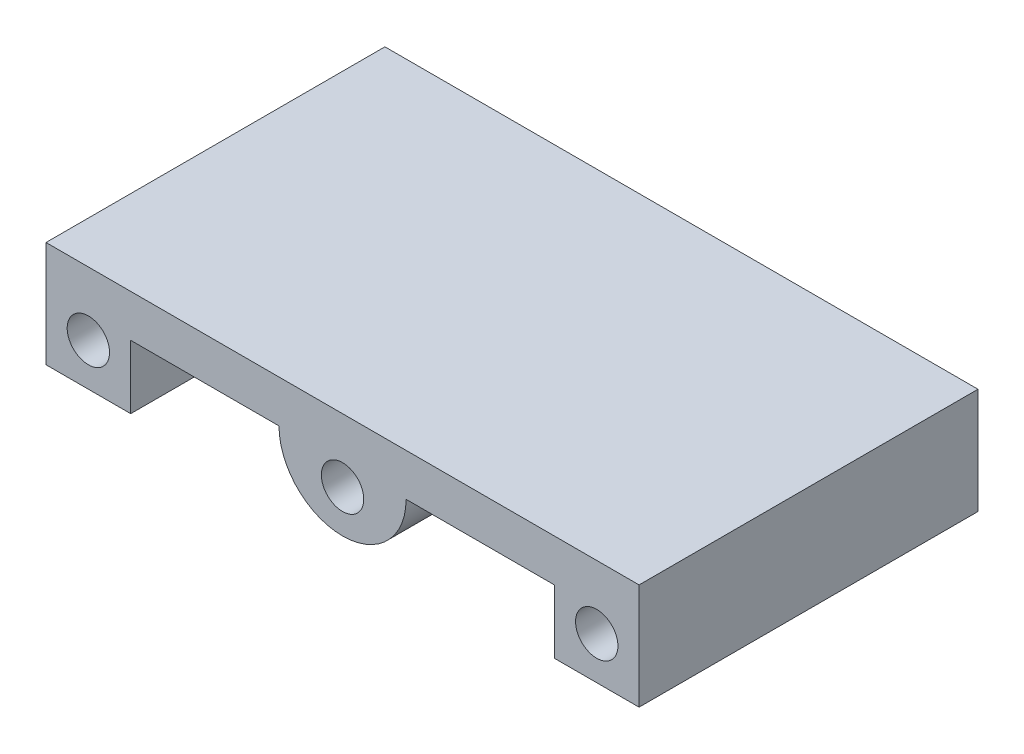
ISO-10303-21;
HEADER;
FILE_DESCRIPTION(('STEP AP214'),'2;1');
FILE_NAME('part.step','',(''),(''),'','','');
FILE_SCHEMA(('AUTOMOTIVE_DESIGN { 1 0 10303 214 1 1 1 1 }'));
ENDSEC;
DATA;
#1=APPLICATION_CONTEXT('core data for automotive mechanical design processes');
#2=APPLICATION_PROTOCOL_DEFINITION('international standard','automotive_design',2000,#1);
#3=PRODUCT_CONTEXT('',#1,'mechanical');
#4=PRODUCT('Part','Part','',(#3));
#5=PRODUCT_RELATED_PRODUCT_CATEGORY('part','',(#4));
#6=PRODUCT_DEFINITION_FORMATION('','',#4);
#7=PRODUCT_DEFINITION_CONTEXT('part definition',#1,'design');
#8=PRODUCT_DEFINITION('design','',#6,#7);
#9=PRODUCT_DEFINITION_SHAPE('','',#8);
#10=(LENGTH_UNIT() NAMED_UNIT(*) SI_UNIT(.MILLI.,.METRE.));
#11=(NAMED_UNIT(*) PLANE_ANGLE_UNIT() SI_UNIT($,.RADIAN.));
#12=(NAMED_UNIT(*) SI_UNIT($,.STERADIAN.) SOLID_ANGLE_UNIT());
#13=UNCERTAINTY_MEASURE_WITH_UNIT(LENGTH_MEASURE(1.E-05),#10,'distance_accuracy_value','');
#14=(GEOMETRIC_REPRESENTATION_CONTEXT(3) GLOBAL_UNCERTAINTY_ASSIGNED_CONTEXT((#13)) GLOBAL_UNIT_ASSIGNED_CONTEXT((#10,
#11,#12)) REPRESENTATION_CONTEXT('',''));
#15=CARTESIAN_POINT('',(0.,0.,0.));
#16=DIRECTION('',(0.,0.,1.));
#17=DIRECTION('',(1.,0.,0.));
#18=AXIS2_PLACEMENT_3D('',#15,#16,#17);
#19=CARTESIAN_POINT('',(0.,0.,0.));
#20=DIRECTION('',(0.,-1.,0.));
#21=DIRECTION('',(0.,0.,-1.));
#22=AXIS2_PLACEMENT_3D('',#19,#20,#21);
#23=PLANE('',#22);
#24=DIRECTION('',(-1.,0.,0.));
#25=VECTOR('',#24,1.);
#26=CARTESIAN_POINT('',(-88.9,0.,-50.8));
#27=LINE('',#26,#25);
#28=CARTESIAN_POINT('',(63.5,0.,-50.8));
#29=VERTEX_POINT('',#28);
#30=CARTESIAN_POINT('',(19.05,0.,-50.8));
#31=VERTEX_POINT('',#30);
#32=EDGE_CURVE('E134',#29,#31,#27,.T.);
#33=ORIENTED_EDGE('',*,*,#32,.F.);
#34=DIRECTION('',(0.,0.,1.));
#35=VECTOR('',#34,1.);
#36=CARTESIAN_POINT('',(63.5,0.,-82.55));
#37=LINE('',#36,#35);
#38=CARTESIAN_POINT('',(63.5,0.,50.8));
#39=VERTEX_POINT('',#38);
#40=EDGE_CURVE('E119',#29,#39,#37,.T.);
#41=ORIENTED_EDGE('',*,*,#40,.T.);
#42=DIRECTION('',(1.,0.,0.));
#43=VECTOR('',#42,1.);
#44=CARTESIAN_POINT('',(-88.9,0.,50.8));
#45=LINE('',#44,#43);
#46=CARTESIAN_POINT('',(19.05,0.,50.8));
#47=VERTEX_POINT('',#46);
#48=EDGE_CURVE('E133',#47,#39,#45,.T.);
#49=ORIENTED_EDGE('',*,*,#48,.F.);
#50=DIRECTION('',(0.,0.,1.));
#51=VECTOR('',#50,1.);
#52=CARTESIAN_POINT('',(19.05,0.,-93.397094971371));
#53=LINE('',#52,#51);
#54=EDGE_CURVE('E190',#31,#47,#53,.T.);
#55=ORIENTED_EDGE('',*,*,#54,.F.);
#56=EDGE_LOOP('',(#33,#41,#49,#55));
#57=FACE_BOUND('',#56,.T.);
#58=ADVANCED_FACE('F36',(#57),#23,.T.);
#59=CARTESIAN_POINT('',(88.9,12.7,50.8));
#60=DIRECTION('',(-1.,0.,0.));
#61=DIRECTION('',(0.,0.,1.));
#62=AXIS2_PLACEMENT_3D('',#59,#60,#61);
#63=PLANE('',#62);
#64=DIRECTION('',(0.,-1.,0.));
#65=VECTOR('',#64,1.);
#66=CARTESIAN_POINT('',(88.9,12.7,50.8));
#67=LINE('',#66,#65);
#68=CARTESIAN_POINT('',(88.9,12.7,50.8));
#69=VERTEX_POINT('',#68);
#70=CARTESIAN_POINT('',(88.9,-19.05,50.8));
#71=VERTEX_POINT('',#70);
#72=EDGE_CURVE('E146',#69,#71,#67,.T.);
#73=ORIENTED_EDGE('',*,*,#72,.T.);
#74=DIRECTION('',(0.,0.,1.));
#75=VECTOR('',#74,1.);
#76=CARTESIAN_POINT('',(88.9,-19.05,-82.55));
#77=LINE('',#76,#75);
#78=CARTESIAN_POINT('',(88.9,-19.05,-50.8));
#79=VERTEX_POINT('',#78);
#80=EDGE_CURVE('E202',#79,#71,#77,.T.);
#81=ORIENTED_EDGE('',*,*,#80,.F.);
#82=DIRECTION('',(0.,-1.,0.));
#83=VECTOR('',#82,1.);
#84=CARTESIAN_POINT('',(88.9,12.7,-50.8));
#85=LINE('',#84,#83);
#86=CARTESIAN_POINT('',(88.9,12.7,-50.8));
#87=VERTEX_POINT('',#86);
#88=EDGE_CURVE('E11',#87,#79,#85,.T.);
#89=ORIENTED_EDGE('',*,*,#88,.F.);
#90=DIRECTION('',(0.,0.,-1.));
#91=VECTOR('',#90,1.);
#92=CARTESIAN_POINT('',(88.9,12.7,50.8));
#93=LINE('',#92,#91);
#94=EDGE_CURVE('E141',#69,#87,#93,.T.);
#95=ORIENTED_EDGE('',*,*,#94,.F.);
#96=EDGE_LOOP('',(#73,#81,#89,#95));
#97=FACE_BOUND('',#96,.T.);
#98=ADVANCED_FACE('F38',(#97),#63,.F.);
#99=CARTESIAN_POINT('',(-88.9,12.7,-50.8));
#100=DIRECTION('',(0.,0.,1.));
#101=DIRECTION('',(1.,0.,0.));
#102=AXIS2_PLACEMENT_3D('',#99,#100,#101);
#103=PLANE('',#102);
#104=CARTESIAN_POINT('',(-76.2,-6.35,-50.8));
#105=DIRECTION('',(0.,0.,1.));
#106=DIRECTION('',(1.,0.,0.));
#107=AXIS2_PLACEMENT_3D('',#104,#105,#106);
#108=CIRCLE('',#107,6.35);
#109=CARTESIAN_POINT('',(-69.85,-6.35,-50.8));
#110=VERTEX_POINT('',#109);
#111=EDGE_CURVE('E128',#110,#110,#108,.F.);
#112=ORIENTED_EDGE('',*,*,#111,.F.);
#113=EDGE_LOOP('',(#112));
#114=FACE_BOUND('',#113,.T.);
#115=CARTESIAN_POINT('',(76.2,-6.35,-50.8));
#116=DIRECTION('',(0.,0.,1.));
#117=DIRECTION('',(1.,0.,0.));
#118=AXIS2_PLACEMENT_3D('',#115,#116,#117);
#119=CIRCLE('',#118,6.35);
#120=CARTESIAN_POINT('',(82.55,-6.35,-50.8));
#121=VERTEX_POINT('',#120);
#122=EDGE_CURVE('E253',#121,#121,#119,.F.);
#123=ORIENTED_EDGE('',*,*,#122,.F.);
#124=EDGE_LOOP('',(#123));
#125=FACE_BOUND('',#124,.T.);
#126=CARTESIAN_POINT('',(0.,-6.35,-50.8));
#127=DIRECTION('',(0.,0.,1.));
#128=DIRECTION('',(1.,0.,0.));
#129=AXIS2_PLACEMENT_3D('',#126,#127,#128);
#130=CIRCLE('',#129,6.35);
#131=CARTESIAN_POINT('',(6.35,-6.35,-50.8));
#132=VERTEX_POINT('',#131);
#133=EDGE_CURVE('E184',#132,#132,#130,.F.);
#134=ORIENTED_EDGE('',*,*,#133,.F.);
#135=EDGE_LOOP('',(#134));
#136=FACE_BOUND('',#135,.T.);
#137=ORIENTED_EDGE('',*,*,#88,.T.);
#138=DIRECTION('',(1.,0.,0.));
#139=VECTOR('',#138,1.);
#140=CARTESIAN_POINT('',(88.9,-19.05,-50.8));
#141=LINE('',#140,#139);
#142=CARTESIAN_POINT('',(63.5,-19.05,-50.8));
#143=VERTEX_POINT('',#142);
#144=EDGE_CURVE('E204',#143,#79,#141,.T.);
#145=ORIENTED_EDGE('',*,*,#144,.F.);
#146=DIRECTION('',(0.,-1.,0.));
#147=VECTOR('',#146,1.);
#148=CARTESIAN_POINT('',(63.5,-19.05,-50.8));
#149=LINE('',#148,#147);
#150=EDGE_CURVE('E205',#29,#143,#149,.T.);
#151=ORIENTED_EDGE('',*,*,#150,.F.);
#152=ORIENTED_EDGE('',*,*,#32,.T.);
#153=CARTESIAN_POINT('',(0.,0.,-50.8));
#154=DIRECTION('',(0.,0.,1.));
#155=DIRECTION('',(1.,0.,0.));
#156=AXIS2_PLACEMENT_3D('',#153,#154,#155);
#157=CIRCLE('',#156,19.05);
#158=CARTESIAN_POINT('',(-19.05,0.,-50.8));
#159=VERTEX_POINT('',#158);
#160=EDGE_CURVE('E187',#31,#159,#157,.F.);
#161=ORIENTED_EDGE('',*,*,#160,.T.);
#162=CARTESIAN_POINT('',(-63.5,0.,-50.8));
#163=VERTEX_POINT('',#162);
#164=EDGE_CURVE('E142',#159,#163,#27,.T.);
#165=ORIENTED_EDGE('',*,*,#164,.T.);
#166=DIRECTION('',(0.,-1.,0.));
#167=VECTOR('',#166,1.);
#168=CARTESIAN_POINT('',(-63.5,-19.05,-50.8));
#169=LINE('',#168,#167);
#170=CARTESIAN_POINT('',(-63.5,-19.05,-50.8));
#171=VERTEX_POINT('',#170);
#172=EDGE_CURVE('E165',#163,#171,#169,.T.);
#173=ORIENTED_EDGE('',*,*,#172,.T.);
#174=DIRECTION('',(-1.,0.,0.));
#175=VECTOR('',#174,1.);
#176=CARTESIAN_POINT('',(-88.9,-19.05,-50.8));
#177=LINE('',#176,#175);
#178=CARTESIAN_POINT('',(-88.9,-19.05,-50.8));
#179=VERTEX_POINT('',#178);
#180=EDGE_CURVE('E162',#171,#179,#177,.T.);
#181=ORIENTED_EDGE('',*,*,#180,.T.);
#182=DIRECTION('',(0.,-1.,0.));
#183=VECTOR('',#182,1.);
#184=CARTESIAN_POINT('',(-88.9,12.7,-50.8));
#185=LINE('',#184,#183);
#186=CARTESIAN_POINT('',(-88.9,12.7,-50.8));
#187=VERTEX_POINT('',#186);
#188=EDGE_CURVE('E44',#187,#179,#185,.T.);
#189=ORIENTED_EDGE('',*,*,#188,.F.);
#190=DIRECTION('',(-1.,0.,0.));
#191=VECTOR('',#190,1.);
#192=CARTESIAN_POINT('',(-88.9,12.7,-50.8));
#193=LINE('',#192,#191);
#194=EDGE_CURVE('E194',#87,#187,#193,.T.);
#195=ORIENTED_EDGE('',*,*,#194,.F.);
#196=EDGE_LOOP('',(#137,#145,#151,#152,#161,#165,#173,#181,#189,#195));
#197=FACE_BOUND('',#196,.T.);
#198=ADVANCED_FACE('F163',(#114,#125,#136,#197),#103,.F.);
#199=CARTESIAN_POINT('',(-88.9,12.7,50.8));
#200=DIRECTION('',(1.,0.,0.));
#201=DIRECTION('',(0.,0.,-1.));
#202=AXIS2_PLACEMENT_3D('',#199,#200,#201);
#203=PLANE('',#202);
#204=ORIENTED_EDGE('',*,*,#188,.T.);
#205=DIRECTION('',(0.,0.,1.));
#206=VECTOR('',#205,1.);
#207=CARTESIAN_POINT('',(-88.9,-19.05,-82.55));
#208=LINE('',#207,#206);
#209=CARTESIAN_POINT('',(-88.9,-19.05,50.8));
#210=VERTEX_POINT('',#209);
#211=EDGE_CURVE('E157',#179,#210,#208,.T.);
#212=ORIENTED_EDGE('',*,*,#211,.T.);
#213=DIRECTION('',(0.,-1.,0.));
#214=VECTOR('',#213,1.);
#215=CARTESIAN_POINT('',(-88.9,12.7,50.8));
#216=LINE('',#215,#214);
#217=CARTESIAN_POINT('',(-88.9,12.7,50.8));
#218=VERTEX_POINT('',#217);
#219=EDGE_CURVE('E148',#218,#210,#216,.T.);
#220=ORIENTED_EDGE('',*,*,#219,.F.);
#221=DIRECTION('',(0.,0.,1.));
#222=VECTOR('',#221,1.);
#223=CARTESIAN_POINT('',(-88.9,12.7,50.8));
#224=LINE('',#223,#222);
#225=EDGE_CURVE('E159',#187,#218,#224,.T.);
#226=ORIENTED_EDGE('',*,*,#225,.F.);
#227=EDGE_LOOP('',(#204,#212,#220,#226));
#228=FACE_BOUND('',#227,.T.);
#229=ADVANCED_FACE('F154',(#228),#203,.F.);
#230=CARTESIAN_POINT('',(-88.9,12.7,50.8));
#231=DIRECTION('',(0.,0.,-1.));
#232=DIRECTION('',(-1.,0.,0.));
#233=AXIS2_PLACEMENT_3D('',#230,#231,#232);
#234=PLANE('',#233);
#235=CARTESIAN_POINT('',(-76.2,-6.35,50.8));
#236=DIRECTION('',(0.,0.,1.));
#237=DIRECTION('',(1.,0.,0.));
#238=AXIS2_PLACEMENT_3D('',#235,#236,#237);
#239=CIRCLE('',#238,6.35);
#240=CARTESIAN_POINT('',(-69.85,-6.35,50.8));
#241=VERTEX_POINT('',#240);
#242=EDGE_CURVE('E259',#241,#241,#239,.T.);
#243=ORIENTED_EDGE('',*,*,#242,.F.);
#244=EDGE_LOOP('',(#243));
#245=FACE_BOUND('',#244,.T.);
#246=CARTESIAN_POINT('',(76.2,-6.35,50.8));
#247=DIRECTION('',(0.,0.,1.));
#248=DIRECTION('',(1.,0.,0.));
#249=AXIS2_PLACEMENT_3D('',#246,#247,#248);
#250=CIRCLE('',#249,6.35);
#251=CARTESIAN_POINT('',(82.55,-6.35,50.8));
#252=VERTEX_POINT('',#251);
#253=EDGE_CURVE('E260',#252,#252,#250,.T.);
#254=ORIENTED_EDGE('',*,*,#253,.F.);
#255=EDGE_LOOP('',(#254));
#256=FACE_BOUND('',#255,.T.);
#257=CARTESIAN_POINT('',(0.,-6.35,50.8));
#258=DIRECTION('',(0.,0.,1.));
#259=DIRECTION('',(1.,0.,0.));
#260=AXIS2_PLACEMENT_3D('',#257,#258,#259);
#261=CIRCLE('',#260,6.35);
#262=CARTESIAN_POINT('',(6.35,-6.35,50.8));
#263=VERTEX_POINT('',#262);
#264=EDGE_CURVE('E181',#263,#263,#261,.T.);
#265=ORIENTED_EDGE('',*,*,#264,.F.);
#266=EDGE_LOOP('',(#265));
#267=FACE_BOUND('',#266,.T.);
#268=ORIENTED_EDGE('',*,*,#219,.T.);
#269=DIRECTION('',(1.,0.,0.));
#270=VECTOR('',#269,1.);
#271=CARTESIAN_POINT('',(-88.9,-19.05,50.8));
#272=LINE('',#271,#270);
#273=CARTESIAN_POINT('',(-63.5,-19.05,50.8));
#274=VERTEX_POINT('',#273);
#275=EDGE_CURVE('E172',#210,#274,#272,.T.);
#276=ORIENTED_EDGE('',*,*,#275,.T.);
#277=DIRECTION('',(0.,1.,0.));
#278=VECTOR('',#277,1.);
#279=CARTESIAN_POINT('',(-63.5,-19.05,50.8));
#280=LINE('',#279,#278);
#281=CARTESIAN_POINT('',(-63.5,0.,50.8));
#282=VERTEX_POINT('',#281);
#283=EDGE_CURVE('E174',#274,#282,#280,.T.);
#284=ORIENTED_EDGE('',*,*,#283,.T.);
#285=CARTESIAN_POINT('',(-19.05,0.,50.8));
#286=VERTEX_POINT('',#285);
#287=EDGE_CURVE('E139',#282,#286,#45,.T.);
#288=ORIENTED_EDGE('',*,*,#287,.T.);
#289=CARTESIAN_POINT('',(0.,0.,50.8));
#290=DIRECTION('',(0.,0.,1.));
#291=DIRECTION('',(1.,0.,0.));
#292=AXIS2_PLACEMENT_3D('',#289,#290,#291);
#293=CIRCLE('',#292,19.05);
#294=EDGE_CURVE('E138',#286,#47,#293,.T.);
#295=ORIENTED_EDGE('',*,*,#294,.T.);
#296=ORIENTED_EDGE('',*,*,#48,.T.);
#297=DIRECTION('',(0.,1.,0.));
#298=VECTOR('',#297,1.);
#299=CARTESIAN_POINT('',(63.5,-19.05,50.8));
#300=LINE('',#299,#298);
#301=CARTESIAN_POINT('',(63.5,-19.05,50.8));
#302=VERTEX_POINT('',#301);
#303=EDGE_CURVE('E115',#302,#39,#300,.T.);
#304=ORIENTED_EDGE('',*,*,#303,.F.);
#305=DIRECTION('',(-1.,0.,0.));
#306=VECTOR('',#305,1.);
#307=CARTESIAN_POINT('',(88.9,-19.05,50.8));
#308=LINE('',#307,#306);
#309=EDGE_CURVE('E127',#71,#302,#308,.T.);
#310=ORIENTED_EDGE('',*,*,#309,.F.);
#311=ORIENTED_EDGE('',*,*,#72,.F.);
#312=DIRECTION('',(1.,0.,0.));
#313=VECTOR('',#312,1.);
#314=CARTESIAN_POINT('',(-88.9,12.7,50.8));
#315=LINE('',#314,#313);
#316=EDGE_CURVE('E59',#218,#69,#315,.T.);
#317=ORIENTED_EDGE('',*,*,#316,.F.);
#318=EDGE_LOOP('',(#268,#276,#284,#288,#295,#296,#304,#310,#311,#317));
#319=FACE_BOUND('',#318,.T.);
#320=ADVANCED_FACE('F137',(#245,#256,#267,#319),#234,.F.);
#321=CARTESIAN_POINT('',(0.,12.7,0.));
#322=DIRECTION('',(0.,-1.,0.));
#323=DIRECTION('',(0.,0.,-1.));
#324=AXIS2_PLACEMENT_3D('',#321,#322,#323);
#325=PLANE('',#324);
#326=ORIENTED_EDGE('',*,*,#94,.T.);
#327=ORIENTED_EDGE('',*,*,#194,.T.);
#328=ORIENTED_EDGE('',*,*,#225,.T.);
#329=ORIENTED_EDGE('',*,*,#316,.T.);
#330=EDGE_LOOP('',(#326,#327,#328,#329));
#331=FACE_BOUND('',#330,.T.);
#332=ADVANCED_FACE('F196',(#331),#325,.F.);
#333=DIRECTION('',(0.,0.,1.));
#334=VECTOR('',#333,1.);
#335=CARTESIAN_POINT('',(-63.5,0.,-82.55));
#336=LINE('',#335,#334);
#337=EDGE_CURVE('E168',#163,#282,#336,.T.);
#338=ORIENTED_EDGE('',*,*,#337,.F.);
#339=ORIENTED_EDGE('',*,*,#164,.F.);
#340=DIRECTION('',(0.,0.,1.));
#341=VECTOR('',#340,1.);
#342=CARTESIAN_POINT('',(-19.05,0.,-93.397094971371));
#343=LINE('',#342,#341);
#344=EDGE_CURVE('E51',#159,#286,#343,.T.);
#345=ORIENTED_EDGE('',*,*,#344,.T.);
#346=ORIENTED_EDGE('',*,*,#287,.F.);
#347=EDGE_LOOP('',(#338,#339,#345,#346));
#348=FACE_BOUND('',#347,.T.);
#349=ADVANCED_FACE('F221',(#348),#23,.T.);
#350=CARTESIAN_POINT('',(0.,0.,-93.397094971371));
#351=DIRECTION('',(0.,0.,1.));
#352=DIRECTION('',(1.,0.,0.));
#353=AXIS2_PLACEMENT_3D('',#350,#351,#352);
#354=CYLINDRICAL_SURFACE('',#353,19.05);
#355=ORIENTED_EDGE('',*,*,#160,.F.);
#356=ORIENTED_EDGE('',*,*,#54,.T.);
#357=ORIENTED_EDGE('',*,*,#294,.F.);
#358=ORIENTED_EDGE('',*,*,#344,.F.);
#359=EDGE_LOOP('',(#355,#356,#357,#358));
#360=FACE_BOUND('',#359,.T.);
#361=ADVANCED_FACE('F222',(#360),#354,.T.);
#362=CARTESIAN_POINT('',(0.,-6.35,-68.7605122421383));
#363=DIRECTION('',(0.,0.,1.));
#364=DIRECTION('',(1.,0.,0.));
#365=AXIS2_PLACEMENT_3D('',#362,#363,#364);
#366=CYLINDRICAL_SURFACE('',#365,6.35);
#367=ORIENTED_EDGE('',*,*,#133,.T.);
#368=EDGE_LOOP('',(#367));
#369=FACE_BOUND('',#368,.T.);
#370=ORIENTED_EDGE('',*,*,#264,.T.);
#371=EDGE_LOOP('',(#370));
#372=FACE_BOUND('',#371,.T.);
#373=ADVANCED_FACE('F224',(#369,#372),#366,.F.);
#374=CARTESIAN_POINT('',(-63.5,-19.05,-82.55));
#375=DIRECTION('',(1.,0.,0.));
#376=DIRECTION('',(0.,0.,-1.));
#377=AXIS2_PLACEMENT_3D('',#374,#375,#376);
#378=PLANE('',#377);
#379=ORIENTED_EDGE('',*,*,#172,.F.);
#380=ORIENTED_EDGE('',*,*,#337,.T.);
#381=ORIENTED_EDGE('',*,*,#283,.F.);
#382=DIRECTION('',(0.,0.,1.));
#383=VECTOR('',#382,1.);
#384=CARTESIAN_POINT('',(-63.5,-19.05,-82.55));
#385=LINE('',#384,#383);
#386=EDGE_CURVE('E173',#171,#274,#385,.T.);
#387=ORIENTED_EDGE('',*,*,#386,.F.);
#388=EDGE_LOOP('',(#379,#380,#381,#387));
#389=FACE_BOUND('',#388,.T.);
#390=ADVANCED_FACE('F217',(#389),#378,.T.);
#391=CARTESIAN_POINT('',(-88.9,-19.05,-82.55));
#392=DIRECTION('',(0.,-1.,0.));
#393=DIRECTION('',(0.,0.,-1.));
#394=AXIS2_PLACEMENT_3D('',#391,#392,#393);
#395=PLANE('',#394);
#396=ORIENTED_EDGE('',*,*,#180,.F.);
#397=ORIENTED_EDGE('',*,*,#386,.T.);
#398=ORIENTED_EDGE('',*,*,#275,.F.);
#399=ORIENTED_EDGE('',*,*,#211,.F.);
#400=EDGE_LOOP('',(#396,#397,#398,#399));
#401=FACE_BOUND('',#400,.T.);
#402=ADVANCED_FACE('F170',(#401),#395,.T.);
#403=CARTESIAN_POINT('',(63.5,-19.05,-82.55));
#404=DIRECTION('',(1.,0.,0.));
#405=DIRECTION('',(0.,0.,-1.));
#406=AXIS2_PLACEMENT_3D('',#403,#404,#405);
#407=PLANE('',#406);
#408=ORIENTED_EDGE('',*,*,#40,.F.);
#409=ORIENTED_EDGE('',*,*,#150,.T.);
#410=DIRECTION('',(0.,0.,1.));
#411=VECTOR('',#410,1.);
#412=CARTESIAN_POINT('',(63.5,-19.05,-82.55));
#413=LINE('',#412,#411);
#414=EDGE_CURVE('E122',#143,#302,#413,.T.);
#415=ORIENTED_EDGE('',*,*,#414,.T.);
#416=ORIENTED_EDGE('',*,*,#303,.T.);
#417=EDGE_LOOP('',(#408,#409,#415,#416));
#418=FACE_BOUND('',#417,.T.);
#419=ADVANCED_FACE('F117',(#418),#407,.F.);
#420=CARTESIAN_POINT('',(88.9,-19.05,-82.55));
#421=DIRECTION('',(0.,1.,0.));
#422=DIRECTION('',(0.,0.,1.));
#423=AXIS2_PLACEMENT_3D('',#420,#421,#422);
#424=PLANE('',#423);
#425=ORIENTED_EDGE('',*,*,#414,.F.);
#426=ORIENTED_EDGE('',*,*,#144,.T.);
#427=ORIENTED_EDGE('',*,*,#80,.T.);
#428=ORIENTED_EDGE('',*,*,#309,.T.);
#429=EDGE_LOOP('',(#425,#426,#427,#428));
#430=FACE_BOUND('',#429,.T.);
#431=ADVANCED_FACE('F208',(#430),#424,.F.);
#432=CARTESIAN_POINT('',(76.2,-6.35,-68.7605122421383));
#433=DIRECTION('',(0.,0.,1.));
#434=DIRECTION('',(1.,0.,0.));
#435=AXIS2_PLACEMENT_3D('',#432,#433,#434);
#436=CYLINDRICAL_SURFACE('',#435,6.35);
#437=ORIENTED_EDGE('',*,*,#122,.T.);
#438=EDGE_LOOP('',(#437));
#439=FACE_BOUND('',#438,.T.);
#440=ORIENTED_EDGE('',*,*,#253,.T.);
#441=EDGE_LOOP('',(#440));
#442=FACE_BOUND('',#441,.T.);
#443=ADVANCED_FACE('F272',(#439,#442),#436,.F.);
#444=CARTESIAN_POINT('',(-76.2,-6.35,-68.7605122421383));
#445=DIRECTION('',(0.,0.,1.));
#446=DIRECTION('',(1.,0.,0.));
#447=AXIS2_PLACEMENT_3D('',#444,#445,#446);
#448=CYLINDRICAL_SURFACE('',#447,6.35);
#449=ORIENTED_EDGE('',*,*,#111,.T.);
#450=EDGE_LOOP('',(#449));
#451=FACE_BOUND('',#450,.T.);
#452=ORIENTED_EDGE('',*,*,#242,.T.);
#453=EDGE_LOOP('',(#452));
#454=FACE_BOUND('',#453,.T.);
#455=ADVANCED_FACE('F269',(#451,#454),#448,.F.);
#456=CLOSED_SHELL('',(#58,#98,#198,#229,#320,#332,#349,#361,#373,#390,#402,#419,#431,#443,#455));
#457=MANIFOLD_SOLID_BREP('B2',#456);
#458=ADVANCED_BREP_SHAPE_REPRESENTATION('',(#18,#457),#14);
#459=SHAPE_DEFINITION_REPRESENTATION(#9,#458);
ENDSEC;
END-ISO-10303-21;
